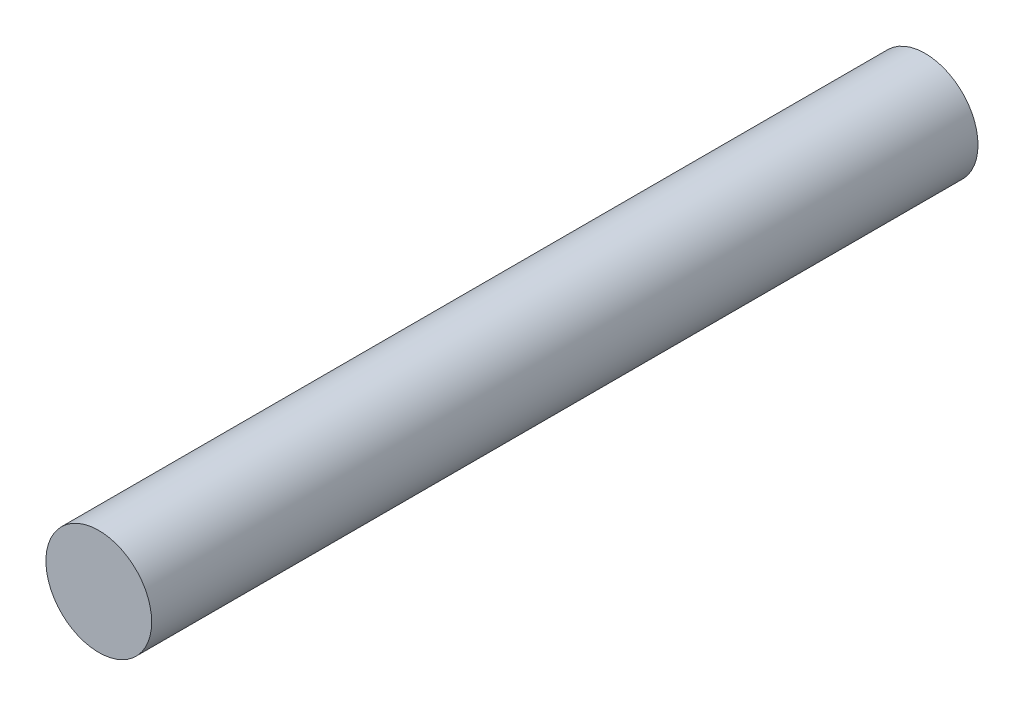
ISO-10303-21;
HEADER;
FILE_DESCRIPTION(('STEP AP214'),'2;1');
FILE_NAME('part.step','',(''),(''),'','','');
FILE_SCHEMA(('AUTOMOTIVE_DESIGN { 1 0 10303 214 1 1 1 1 }'));
ENDSEC;
DATA;
#1=APPLICATION_CONTEXT('core data for automotive mechanical design processes');
#2=APPLICATION_PROTOCOL_DEFINITION('international standard','automotive_design',2000,#1);
#3=PRODUCT_CONTEXT('',#1,'mechanical');
#4=PRODUCT('Part','Part','',(#3));
#5=PRODUCT_RELATED_PRODUCT_CATEGORY('part','',(#4));
#6=PRODUCT_DEFINITION_FORMATION('','',#4);
#7=PRODUCT_DEFINITION_CONTEXT('part definition',#1,'design');
#8=PRODUCT_DEFINITION('design','',#6,#7);
#9=PRODUCT_DEFINITION_SHAPE('','',#8);
#10=(LENGTH_UNIT() NAMED_UNIT(*) SI_UNIT(.MILLI.,.METRE.));
#11=(NAMED_UNIT(*) PLANE_ANGLE_UNIT() SI_UNIT($,.RADIAN.));
#12=(NAMED_UNIT(*) SI_UNIT($,.STERADIAN.) SOLID_ANGLE_UNIT());
#13=UNCERTAINTY_MEASURE_WITH_UNIT(LENGTH_MEASURE(1.E-05),#10,'distance_accuracy_value','');
#14=(GEOMETRIC_REPRESENTATION_CONTEXT(3) GLOBAL_UNCERTAINTY_ASSIGNED_CONTEXT((#13)) GLOBAL_UNIT_ASSIGNED_CONTEXT((#10,
#11,#12)) REPRESENTATION_CONTEXT('',''));
#15=CARTESIAN_POINT('',(0.,0.,0.));
#16=DIRECTION('',(0.,0.,1.));
#17=DIRECTION('',(1.,0.,0.));
#18=AXIS2_PLACEMENT_3D('',#15,#16,#17);
#19=CARTESIAN_POINT('',(0.,0.,12.5));
#20=DIRECTION('',(0.,0.,-1.));
#21=DIRECTION('',(-1.,0.,0.));
#22=AXIS2_PLACEMENT_3D('',#19,#20,#21);
#23=CYLINDRICAL_SURFACE('',#22,1.6);
#24=CARTESIAN_POINT('',(0.,0.,12.5));
#25=DIRECTION('',(0.,0.,1.));
#26=DIRECTION('',(1.,0.,0.));
#27=AXIS2_PLACEMENT_3D('',#24,#25,#26);
#28=CIRCLE('',#27,1.6);
#29=CARTESIAN_POINT('',(1.6,0.,12.5));
#30=VERTEX_POINT('',#29);
#31=EDGE_CURVE('E10',#30,#30,#28,.T.);
#32=ORIENTED_EDGE('',*,*,#31,.F.);
#33=EDGE_LOOP('',(#32));
#34=FACE_BOUND('',#33,.T.);
#35=CARTESIAN_POINT('',(0.,0.,-12.5));
#36=DIRECTION('',(0.,0.,1.));
#37=DIRECTION('',(1.,0.,0.));
#38=AXIS2_PLACEMENT_3D('',#35,#36,#37);
#39=CIRCLE('',#38,1.6);
#40=CARTESIAN_POINT('',(1.6,0.,-12.5));
#41=VERTEX_POINT('',#40);
#42=EDGE_CURVE('E33',#41,#41,#39,.T.);
#43=ORIENTED_EDGE('',*,*,#42,.T.);
#44=EDGE_LOOP('',(#43));
#45=FACE_BOUND('',#44,.T.);
#46=ADVANCED_FACE('F30',(#34,#45),#23,.T.);
#47=CARTESIAN_POINT('',(0.,0.,12.5));
#48=DIRECTION('',(0.,0.,1.));
#49=DIRECTION('',(1.,0.,0.));
#50=AXIS2_PLACEMENT_3D('',#47,#48,#49);
#51=PLANE('',#50);
#52=ORIENTED_EDGE('',*,*,#31,.T.);
#53=EDGE_LOOP('',(#52));
#54=FACE_BOUND('',#53,.T.);
#55=ADVANCED_FACE('F45',(#54),#51,.T.);
#56=CARTESIAN_POINT('',(0.,0.,-12.5));
#57=DIRECTION('',(0.,0.,1.));
#58=DIRECTION('',(1.,0.,0.));
#59=AXIS2_PLACEMENT_3D('',#56,#57,#58);
#60=PLANE('',#59);
#61=ORIENTED_EDGE('',*,*,#42,.F.);
#62=EDGE_LOOP('',(#61));
#63=FACE_BOUND('',#62,.T.);
#64=ADVANCED_FACE('F43',(#63),#60,.F.);
#65=CLOSED_SHELL('',(#46,#55,#64));
#66=MANIFOLD_SOLID_BREP('B2',#65);
#67=ADVANCED_BREP_SHAPE_REPRESENTATION('',(#18,#66),#14);
#68=SHAPE_DEFINITION_REPRESENTATION(#9,#67);
ENDSEC;
END-ISO-10303-21;
